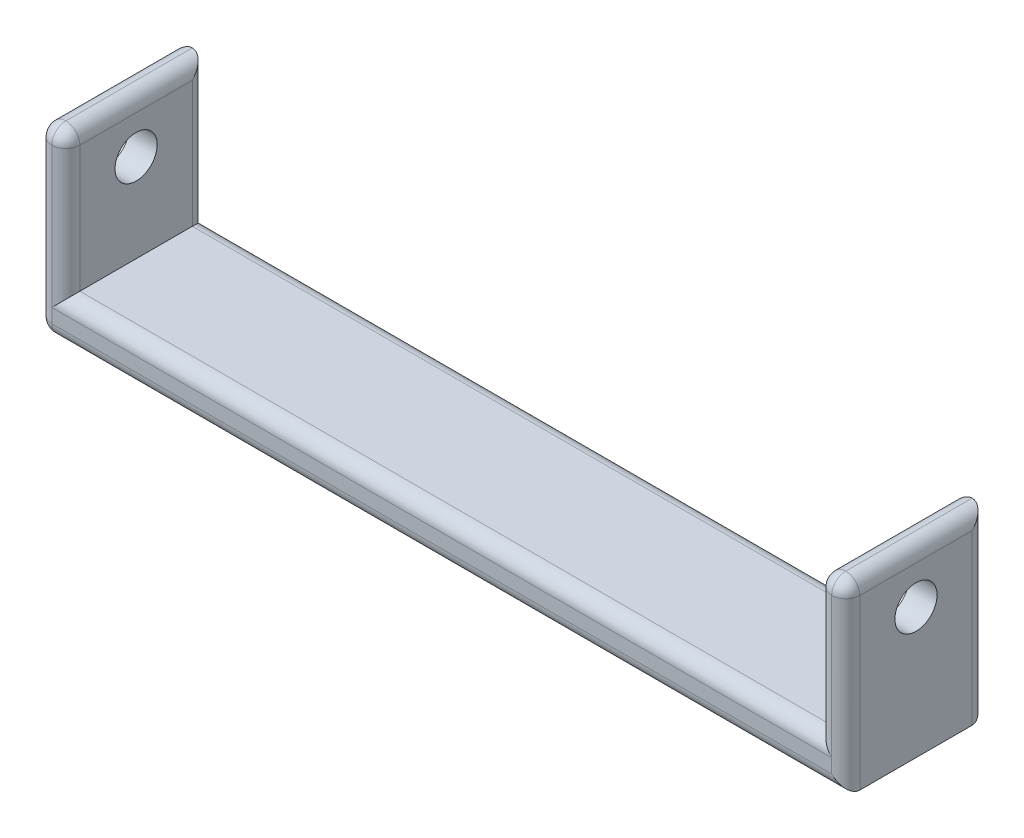
ISO-10303-21;
HEADER;
FILE_DESCRIPTION(('STEP AP214'),'2;1');
FILE_NAME('part.step','',(''),(''),'','','');
FILE_SCHEMA(('AUTOMOTIVE_DESIGN { 1 0 10303 214 1 1 1 1 }'));
ENDSEC;
DATA;
#1=APPLICATION_CONTEXT('core data for automotive mechanical design processes');
#2=APPLICATION_PROTOCOL_DEFINITION('international standard','automotive_design',2000,#1);
#3=PRODUCT_CONTEXT('',#1,'mechanical');
#4=PRODUCT('Part','Part','',(#3));
#5=PRODUCT_RELATED_PRODUCT_CATEGORY('part','',(#4));
#6=PRODUCT_DEFINITION_FORMATION('','',#4);
#7=PRODUCT_DEFINITION_CONTEXT('part definition',#1,'design');
#8=PRODUCT_DEFINITION('design','',#6,#7);
#9=PRODUCT_DEFINITION_SHAPE('','',#8);
#10=(LENGTH_UNIT() NAMED_UNIT(*) SI_UNIT(.MILLI.,.METRE.));
#11=(NAMED_UNIT(*) PLANE_ANGLE_UNIT() SI_UNIT($,.RADIAN.));
#12=(NAMED_UNIT(*) SI_UNIT($,.STERADIAN.) SOLID_ANGLE_UNIT());
#13=UNCERTAINTY_MEASURE_WITH_UNIT(LENGTH_MEASURE(1.E-05),#10,'distance_accuracy_value','');
#14=(GEOMETRIC_REPRESENTATION_CONTEXT(3) GLOBAL_UNCERTAINTY_ASSIGNED_CONTEXT((#13)) GLOBAL_UNIT_ASSIGNED_CONTEXT((#10,
#11,#12)) REPRESENTATION_CONTEXT('',''));
#15=CARTESIAN_POINT('',(0.,0.,0.));
#16=DIRECTION('',(0.,0.,1.));
#17=DIRECTION('',(1.,0.,0.));
#18=AXIS2_PLACEMENT_3D('',#15,#16,#17);
#19=CARTESIAN_POINT('',(0.,3.,0.));
#20=DIRECTION('',(0.,1.,0.));
#21=DIRECTION('',(0.,0.,1.));
#22=AXIS2_PLACEMENT_3D('',#19,#20,#21);
#23=PLANE('',#22);
#24=DIRECTION('',(0.,0.,-1.));
#25=VECTOR('',#24,1.);
#26=CARTESIAN_POINT('',(-26.75,3.,-5.));
#27=LINE('',#26,#25);
#28=CARTESIAN_POINT('',(-26.75,3.,4.));
#29=VERTEX_POINT('',#28);
#30=CARTESIAN_POINT('',(-26.75,3.,-4.));
#31=VERTEX_POINT('',#30);
#32=EDGE_CURVE('E252',#29,#31,#27,.T.);
#33=ORIENTED_EDGE('',*,*,#32,.F.);
#34=DIRECTION('',(1.,0.,0.));
#35=VECTOR('',#34,1.);
#36=CARTESIAN_POINT('',(26.75,3.,4.));
#37=LINE('',#36,#35);
#38=CARTESIAN_POINT('',(26.75,3.,4.));
#39=VERTEX_POINT('',#38);
#40=EDGE_CURVE('E287',#29,#39,#37,.T.);
#41=ORIENTED_EDGE('',*,*,#40,.T.);
#42=DIRECTION('',(0.,0.,1.));
#43=VECTOR('',#42,1.);
#44=CARTESIAN_POINT('',(26.75,3.,-5.));
#45=LINE('',#44,#43);
#46=CARTESIAN_POINT('',(26.75,3.,-4.));
#47=VERTEX_POINT('',#46);
#48=EDGE_CURVE('E249',#47,#39,#45,.T.);
#49=ORIENTED_EDGE('',*,*,#48,.F.);
#50=DIRECTION('',(-1.,0.,0.));
#51=VECTOR('',#50,1.);
#52=CARTESIAN_POINT('',(-26.75,3.,-4.));
#53=LINE('',#52,#51);
#54=EDGE_CURVE('E285',#47,#31,#53,.T.);
#55=ORIENTED_EDGE('',*,*,#54,.T.);
#56=EDGE_LOOP('',(#33,#41,#49,#55));
#57=FACE_BOUND('',#56,.T.);
#58=ADVANCED_FACE('F34',(#57),#23,.T.);
#59=CARTESIAN_POINT('',(28.75,3.,-5.));
#60=DIRECTION('',(-1.,0.,0.));
#61=DIRECTION('',(0.,0.,1.));
#62=AXIS2_PLACEMENT_3D('',#59,#60,#61);
#63=PLANE('',#62);
#64=CARTESIAN_POINT('',(28.75,9.2874124257943,0.));
#65=DIRECTION('',(-1.,0.,0.));
#66=DIRECTION('',(0.,0.,1.));
#67=AXIS2_PLACEMENT_3D('',#64,#65,#66);
#68=CIRCLE('',#67,1.5);
#69=CARTESIAN_POINT('',(28.75,9.2874124257943,1.5));
#70=VERTEX_POINT('',#69);
#71=EDGE_CURVE('E238',#70,#70,#68,.T.);
#72=ORIENTED_EDGE('',*,*,#71,.T.);
#73=EDGE_LOOP('',(#72));
#74=FACE_BOUND('',#73,.T.);
#75=DIRECTION('',(0.,0.,-1.));
#76=VECTOR('',#75,1.);
#77=CARTESIAN_POINT('',(28.75,12.,5.));
#78=LINE('',#77,#76);
#79=CARTESIAN_POINT('',(28.75,12.,-4.));
#80=VERTEX_POINT('',#79);
#81=CARTESIAN_POINT('',(28.75,12.,4.));
#82=VERTEX_POINT('',#81);
#83=EDGE_CURVE('E297',#80,#82,#78,.F.);
#84=ORIENTED_EDGE('',*,*,#83,.T.);
#85=DIRECTION('',(0.,-1.,0.));
#86=VECTOR('',#85,1.);
#87=CARTESIAN_POINT('',(28.75,3.,4.));
#88=LINE('',#87,#86);
#89=CARTESIAN_POINT('',(28.75,0.,4.));
#90=VERTEX_POINT('',#89);
#91=EDGE_CURVE('E299',#82,#90,#88,.T.);
#92=ORIENTED_EDGE('',*,*,#91,.T.);
#93=DIRECTION('',(0.,0.,-1.));
#94=VECTOR('',#93,1.);
#95=CARTESIAN_POINT('',(28.75,0.,-5.));
#96=LINE('',#95,#94);
#97=CARTESIAN_POINT('',(28.75,0.,-4.));
#98=VERTEX_POINT('',#97);
#99=EDGE_CURVE('E255',#90,#98,#96,.T.);
#100=ORIENTED_EDGE('',*,*,#99,.T.);
#101=DIRECTION('',(0.,-1.,0.));
#102=VECTOR('',#101,1.);
#103=CARTESIAN_POINT('',(28.75,3.,-4.));
#104=LINE('',#103,#102);
#105=EDGE_CURVE('E295',#98,#80,#104,.F.);
#106=ORIENTED_EDGE('',*,*,#105,.T.);
#107=EDGE_LOOP('',(#84,#92,#100,#106));
#108=FACE_BOUND('',#107,.T.);
#109=ADVANCED_FACE('F383',(#74,#108),#63,.F.);
#110=CARTESIAN_POINT('',(-28.75,3.,-5.));
#111=DIRECTION('',(0.,0.,1.));
#112=DIRECTION('',(1.,0.,0.));
#113=AXIS2_PLACEMENT_3D('',#110,#111,#112);
#114=PLANE('',#113);
#115=DIRECTION('',(0.,-1.,0.));
#116=VECTOR('',#115,1.);
#117=CARTESIAN_POINT('',(-27.75,3.,-5.));
#118=LINE('',#117,#116);
#119=CARTESIAN_POINT('',(-27.75,1.,-5.));
#120=VERTEX_POINT('',#119);
#121=CARTESIAN_POINT('',(-27.75,2.,-5.));
#122=VERTEX_POINT('',#121);
#123=EDGE_CURVE('E163',#120,#122,#118,.F.);
#124=ORIENTED_EDGE('',*,*,#123,.T.);
#125=DIRECTION('',(-1.,0.,0.));
#126=VECTOR('',#125,1.);
#127=CARTESIAN_POINT('',(26.75,2.,-5.));
#128=LINE('',#127,#126);
#129=CARTESIAN_POINT('',(27.75,2.,-5.));
#130=VERTEX_POINT('',#129);
#131=EDGE_CURVE('E11',#122,#130,#128,.F.);
#132=ORIENTED_EDGE('',*,*,#131,.T.);
#133=DIRECTION('',(0.,-1.,0.));
#134=VECTOR('',#133,1.);
#135=CARTESIAN_POINT('',(27.75,3.,-5.));
#136=LINE('',#135,#134);
#137=CARTESIAN_POINT('',(27.75,1.,-5.));
#138=VERTEX_POINT('',#137);
#139=EDGE_CURVE('E44',#130,#138,#136,.T.);
#140=ORIENTED_EDGE('',*,*,#139,.T.);
#141=DIRECTION('',(-1.,0.,0.));
#142=VECTOR('',#141,1.);
#143=CARTESIAN_POINT('',(-28.75,1.,-5.));
#144=LINE('',#143,#142);
#145=EDGE_CURVE('E160',#138,#120,#144,.T.);
#146=ORIENTED_EDGE('',*,*,#145,.T.);
#147=EDGE_LOOP('',(#124,#132,#140,#146));
#148=FACE_BOUND('',#147,.T.);
#149=ADVANCED_FACE('F162',(#148),#114,.F.);
#150=CARTESIAN_POINT('',(-28.75,3.,-5.));
#151=DIRECTION('',(1.,0.,0.));
#152=DIRECTION('',(0.,0.,-1.));
#153=AXIS2_PLACEMENT_3D('',#150,#151,#152);
#154=PLANE('',#153);
#155=DIRECTION('',(0.,0.,1.));
#156=VECTOR('',#155,1.);
#157=CARTESIAN_POINT('',(-28.75,1.,-5.));
#158=LINE('',#157,#156);
#159=CARTESIAN_POINT('',(-28.75,1.,-4.));
#160=VERTEX_POINT('',#159);
#161=CARTESIAN_POINT('',(-28.75,1.,4.));
#162=VERTEX_POINT('',#161);
#163=EDGE_CURVE('E271',#160,#162,#158,.T.);
#164=ORIENTED_EDGE('',*,*,#163,.T.);
#165=DIRECTION('',(0.,-1.,0.));
#166=VECTOR('',#165,1.);
#167=CARTESIAN_POINT('',(-28.75,3.,4.));
#168=LINE('',#167,#166);
#169=CARTESIAN_POINT('',(-28.75,12.,4.));
#170=VERTEX_POINT('',#169);
#171=EDGE_CURVE('E275',#162,#170,#168,.F.);
#172=ORIENTED_EDGE('',*,*,#171,.T.);
#173=DIRECTION('',(0.,0.,1.));
#174=VECTOR('',#173,1.);
#175=CARTESIAN_POINT('',(-28.75,12.,-5.));
#176=LINE('',#175,#174);
#177=CARTESIAN_POINT('',(-28.75,12.,-4.));
#178=VERTEX_POINT('',#177);
#179=EDGE_CURVE('E273',#170,#178,#176,.F.);
#180=ORIENTED_EDGE('',*,*,#179,.T.);
#181=DIRECTION('',(0.,-1.,0.));
#182=VECTOR('',#181,1.);
#183=CARTESIAN_POINT('',(-28.75,3.,-4.));
#184=LINE('',#183,#182);
#185=EDGE_CURVE('E269',#178,#160,#184,.T.);
#186=ORIENTED_EDGE('',*,*,#185,.T.);
#187=EDGE_LOOP('',(#164,#172,#180,#186));
#188=FACE_BOUND('',#187,.T.);
#189=CARTESIAN_POINT('',(-28.75,9.2874124257943,0.));
#190=DIRECTION('',(-1.,0.,0.));
#191=DIRECTION('',(0.,0.,1.));
#192=AXIS2_PLACEMENT_3D('',#189,#190,#191);
#193=CIRCLE('',#192,1.5);
#194=CARTESIAN_POINT('',(-28.75,9.2874124257943,1.5));
#195=VERTEX_POINT('',#194);
#196=EDGE_CURVE('E233',#195,#195,#193,.T.);
#197=ORIENTED_EDGE('',*,*,#196,.F.);
#198=EDGE_LOOP('',(#197));
#199=FACE_BOUND('',#198,.T.);
#200=ADVANCED_FACE('F400',(#188,#199),#154,.F.);
#201=CARTESIAN_POINT('',(-28.75,3.,5.));
#202=DIRECTION('',(0.,0.,-1.));
#203=DIRECTION('',(-1.,0.,0.));
#204=AXIS2_PLACEMENT_3D('',#201,#202,#203);
#205=PLANE('',#204);
#206=DIRECTION('',(1.,0.,0.));
#207=VECTOR('',#206,1.);
#208=CARTESIAN_POINT('',(-26.75,2.,5.));
#209=LINE('',#208,#207);
#210=CARTESIAN_POINT('',(27.75,2.,5.));
#211=VERTEX_POINT('',#210);
#212=CARTESIAN_POINT('',(-27.75,2.,5.));
#213=VERTEX_POINT('',#212);
#214=EDGE_CURVE('E264',#211,#213,#209,.F.);
#215=ORIENTED_EDGE('',*,*,#214,.T.);
#216=DIRECTION('',(0.,-1.,0.));
#217=VECTOR('',#216,1.);
#218=CARTESIAN_POINT('',(-27.75,3.,5.));
#219=LINE('',#218,#217);
#220=CARTESIAN_POINT('',(-27.75,1.,5.));
#221=VERTEX_POINT('',#220);
#222=EDGE_CURVE('E266',#213,#221,#219,.T.);
#223=ORIENTED_EDGE('',*,*,#222,.T.);
#224=DIRECTION('',(1.,0.,0.));
#225=VECTOR('',#224,1.);
#226=CARTESIAN_POINT('',(-28.75,1.,5.));
#227=LINE('',#226,#225);
#228=CARTESIAN_POINT('',(27.75,1.,5.));
#229=VERTEX_POINT('',#228);
#230=EDGE_CURVE('E258',#221,#229,#227,.T.);
#231=ORIENTED_EDGE('',*,*,#230,.T.);
#232=DIRECTION('',(0.,-1.,0.));
#233=VECTOR('',#232,1.);
#234=CARTESIAN_POINT('',(27.75,3.,5.));
#235=LINE('',#234,#233);
#236=EDGE_CURVE('E262',#229,#211,#235,.F.);
#237=ORIENTED_EDGE('',*,*,#236,.T.);
#238=EDGE_LOOP('',(#215,#223,#231,#237));
#239=FACE_BOUND('',#238,.T.);
#240=ADVANCED_FACE('F396',(#239),#205,.F.);
#241=CARTESIAN_POINT('',(0.,0.,0.));
#242=DIRECTION('',(0.,1.,0.));
#243=DIRECTION('',(0.,0.,1.));
#244=AXIS2_PLACEMENT_3D('',#241,#242,#243);
#245=PLANE('',#244);
#246=ORIENTED_EDGE('',*,*,#99,.F.);
#247=DIRECTION('',(1.,0.,0.));
#248=VECTOR('',#247,1.);
#249=CARTESIAN_POINT('',(0.,0.,4.));
#250=LINE('',#249,#248);
#251=CARTESIAN_POINT('',(-27.75,0.,4.));
#252=VERTEX_POINT('',#251);
#253=EDGE_CURVE('E168',#90,#252,#250,.F.);
#254=ORIENTED_EDGE('',*,*,#253,.T.);
#255=DIRECTION('',(0.,0.,1.));
#256=VECTOR('',#255,1.);
#257=CARTESIAN_POINT('',(-27.75,0.,0.));
#258=LINE('',#257,#256);
#259=CARTESIAN_POINT('',(-27.75,0.,-4.));
#260=VERTEX_POINT('',#259);
#261=EDGE_CURVE('E303',#252,#260,#258,.F.);
#262=ORIENTED_EDGE('',*,*,#261,.T.);
#263=DIRECTION('',(-1.,0.,0.));
#264=VECTOR('',#263,1.);
#265=CARTESIAN_POINT('',(0.,0.,-4.));
#266=LINE('',#265,#264);
#267=EDGE_CURVE('E185',#260,#98,#266,.F.);
#268=ORIENTED_EDGE('',*,*,#267,.T.);
#269=EDGE_LOOP('',(#246,#254,#262,#268));
#270=FACE_BOUND('',#269,.T.);
#271=ADVANCED_FACE('F393',(#270),#245,.F.);
#272=CARTESIAN_POINT('',(-26.75,13.,-5.));
#273=DIRECTION('',(-1.,0.,0.));
#274=DIRECTION('',(0.,0.,1.));
#275=AXIS2_PLACEMENT_3D('',#272,#273,#274);
#276=PLANE('',#275);
#277=CARTESIAN_POINT('',(-26.75,9.2874124257943,0.));
#278=DIRECTION('',(-1.,0.,0.));
#279=DIRECTION('',(0.,0.,1.));
#280=AXIS2_PLACEMENT_3D('',#277,#278,#279);
#281=CIRCLE('',#280,1.5);
#282=CARTESIAN_POINT('',(-26.75,9.2874124257943,1.5));
#283=VERTEX_POINT('',#282);
#284=EDGE_CURVE('E246',#283,#283,#281,.T.);
#285=ORIENTED_EDGE('',*,*,#284,.T.);
#286=EDGE_LOOP('',(#285));
#287=FACE_BOUND('',#286,.T.);
#288=DIRECTION('',(0.,0.,-1.));
#289=VECTOR('',#288,1.);
#290=CARTESIAN_POINT('',(-26.75,12.,-5.));
#291=LINE('',#290,#289);
#292=CARTESIAN_POINT('',(-26.75,12.,-4.));
#293=VERTEX_POINT('',#292);
#294=CARTESIAN_POINT('',(-26.75,12.,4.));
#295=VERTEX_POINT('',#294);
#296=EDGE_CURVE('E280',#293,#295,#291,.F.);
#297=ORIENTED_EDGE('',*,*,#296,.T.);
#298=DIRECTION('',(0.,-1.,0.));
#299=VECTOR('',#298,1.);
#300=CARTESIAN_POINT('',(-26.75,13.,4.));
#301=LINE('',#300,#299);
#302=EDGE_CURVE('E282',#295,#29,#301,.T.);
#303=ORIENTED_EDGE('',*,*,#302,.T.);
#304=ORIENTED_EDGE('',*,*,#32,.T.);
#305=DIRECTION('',(0.,-1.,0.));
#306=VECTOR('',#305,1.);
#307=CARTESIAN_POINT('',(-26.75,13.,-4.));
#308=LINE('',#307,#306);
#309=EDGE_CURVE('E278',#31,#293,#308,.F.);
#310=ORIENTED_EDGE('',*,*,#309,.T.);
#311=EDGE_LOOP('',(#297,#303,#304,#310));
#312=FACE_BOUND('',#311,.T.);
#313=ADVANCED_FACE('F362',(#287,#312),#276,.F.);
#314=CARTESIAN_POINT('',(26.75,13.,-5.));
#315=DIRECTION('',(1.,0.,0.));
#316=DIRECTION('',(0.,0.,-1.));
#317=AXIS2_PLACEMENT_3D('',#314,#315,#316);
#318=PLANE('',#317);
#319=CARTESIAN_POINT('',(26.75,9.2874124257943,0.));
#320=DIRECTION('',(1.,0.,0.));
#321=DIRECTION('',(0.,0.,-1.));
#322=AXIS2_PLACEMENT_3D('',#319,#320,#321);
#323=CIRCLE('',#322,1.5);
#324=CARTESIAN_POINT('',(26.75,9.2874124257943,-1.5));
#325=VERTEX_POINT('',#324);
#326=EDGE_CURVE('E243',#325,#325,#323,.T.);
#327=ORIENTED_EDGE('',*,*,#326,.T.);
#328=EDGE_LOOP('',(#327));
#329=FACE_BOUND('',#328,.T.);
#330=ORIENTED_EDGE('',*,*,#48,.T.);
#331=DIRECTION('',(0.,-1.,0.));
#332=VECTOR('',#331,1.);
#333=CARTESIAN_POINT('',(26.75,13.,4.));
#334=LINE('',#333,#332);
#335=CARTESIAN_POINT('',(26.75,12.,4.));
#336=VERTEX_POINT('',#335);
#337=EDGE_CURVE('E293',#39,#336,#334,.F.);
#338=ORIENTED_EDGE('',*,*,#337,.T.);
#339=DIRECTION('',(0.,0.,1.));
#340=VECTOR('',#339,1.);
#341=CARTESIAN_POINT('',(26.75,12.,-5.));
#342=LINE('',#341,#340);
#343=CARTESIAN_POINT('',(26.75,12.,-4.));
#344=VERTEX_POINT('',#343);
#345=EDGE_CURVE('E291',#336,#344,#342,.F.);
#346=ORIENTED_EDGE('',*,*,#345,.T.);
#347=DIRECTION('',(0.,-1.,0.));
#348=VECTOR('',#347,1.);
#349=CARTESIAN_POINT('',(26.75,13.,-4.));
#350=LINE('',#349,#348);
#351=EDGE_CURVE('E289',#344,#47,#350,.T.);
#352=ORIENTED_EDGE('',*,*,#351,.T.);
#353=EDGE_LOOP('',(#330,#338,#346,#352));
#354=FACE_BOUND('',#353,.T.);
#355=ADVANCED_FACE('F476',(#329,#354),#318,.F.);
#356=CARTESIAN_POINT('',(28.75,9.2874124257943,0.));
#357=DIRECTION('',(-1.,0.,0.));
#358=DIRECTION('',(0.,0.,1.));
#359=AXIS2_PLACEMENT_3D('',#356,#357,#358);
#360=CYLINDRICAL_SURFACE('',#359,1.5);
#361=ORIENTED_EDGE('',*,*,#71,.F.);
#362=EDGE_LOOP('',(#361));
#363=FACE_BOUND('',#362,.T.);
#364=ORIENTED_EDGE('',*,*,#326,.F.);
#365=EDGE_LOOP('',(#364));
#366=FACE_BOUND('',#365,.T.);
#367=ADVANCED_FACE('F478',(#363,#366),#360,.F.);
#368=ORIENTED_EDGE('',*,*,#196,.T.);
#369=EDGE_LOOP('',(#368));
#370=FACE_BOUND('',#369,.T.);
#371=ORIENTED_EDGE('',*,*,#284,.F.);
#372=EDGE_LOOP('',(#371));
#373=FACE_BOUND('',#372,.T.);
#374=ADVANCED_FACE('F484',(#370,#373),#360,.F.);
#375=CARTESIAN_POINT('',(27.75,13.,-4.));
#376=DIRECTION('',(0.,-1.,0.));
#377=DIRECTION('',(0.,0.,-1.));
#378=AXIS2_PLACEMENT_3D('',#375,#376,#377);
#379=CYLINDRICAL_SURFACE('',#378,1.);
#380=DIRECTION('',(0.,-1.,0.));
#381=VECTOR('',#380,1.);
#382=CARTESIAN_POINT('',(27.75,3.,-5.));
#383=LINE('',#382,#381);
#384=CARTESIAN_POINT('',(27.75,13.,-5.));
#385=VERTEX_POINT('',#384);
#386=EDGE_CURVE('E223',#130,#385,#383,.F.);
#387=ORIENTED_EDGE('',*,*,#386,.F.);
#388=CARTESIAN_POINT('',(27.75,2.,-4.));
#389=DIRECTION('',(0.707106781186547,0.707106781186547,0.));
#390=DIRECTION('',(0.707106781186547,-0.707106781186547,0.));
#391=AXIS2_PLACEMENT_3D('',#388,#389,#390);
#392=ELLIPSE('',#391,1.41421356237309,1.);
#393=EDGE_CURVE('E38',#47,#130,#392,.F.);
#394=ORIENTED_EDGE('',*,*,#393,.F.);
#395=ORIENTED_EDGE('',*,*,#351,.F.);
#396=CARTESIAN_POINT('',(27.75,12.,-4.));
#397=DIRECTION('',(0.,-0.707106781186547,-0.707106781186547));
#398=DIRECTION('',(0.,-0.707106781186547,0.707106781186547));
#399=AXIS2_PLACEMENT_3D('',#396,#397,#398);
#400=ELLIPSE('',#399,1.41421356237309,1.);
#401=EDGE_CURVE('E82',#385,#344,#400,.F.);
#402=ORIENTED_EDGE('',*,*,#401,.F.);
#403=EDGE_LOOP('',(#387,#394,#395,#402));
#404=FACE_BOUND('',#403,.T.);
#405=ADVANCED_FACE('F36',(#404),#379,.T.);
#406=CARTESIAN_POINT('',(0.,2.,-4.));
#407=DIRECTION('',(1.,0.,0.));
#408=DIRECTION('',(0.,0.,-1.));
#409=AXIS2_PLACEMENT_3D('',#406,#407,#408);
#410=CYLINDRICAL_SURFACE('',#409,1.);
#411=ORIENTED_EDGE('',*,*,#393,.T.);
#412=ORIENTED_EDGE('',*,*,#131,.F.);
#413=CARTESIAN_POINT('',(-27.75,2.,-4.));
#414=DIRECTION('',(0.707106781186547,-0.707106781186547,0.));
#415=DIRECTION('',(0.707106781186547,0.707106781186547,0.));
#416=AXIS2_PLACEMENT_3D('',#413,#414,#415);
#417=ELLIPSE('',#416,1.41421356237309,1.);
#418=EDGE_CURVE('E220',#31,#122,#417,.F.);
#419=ORIENTED_EDGE('',*,*,#418,.F.);
#420=ORIENTED_EDGE('',*,*,#54,.F.);
#421=EDGE_LOOP('',(#411,#412,#419,#420));
#422=FACE_BOUND('',#421,.T.);
#423=ADVANCED_FACE('F366',(#422),#410,.T.);
#424=CARTESIAN_POINT('',(27.75,12.,0.));
#425=DIRECTION('',(0.,0.,-1.));
#426=DIRECTION('',(-1.,0.,0.));
#427=AXIS2_PLACEMENT_3D('',#424,#425,#426);
#428=CYLINDRICAL_SURFACE('',#427,1.);
#429=CARTESIAN_POINT('',(27.75,12.,4.));
#430=DIRECTION('',(0.,0.,1.));
#431=DIRECTION('',(1.,0.,0.));
#432=AXIS2_PLACEMENT_3D('',#429,#430,#431);
#433=CIRCLE('',#432,1.);
#434=CARTESIAN_POINT('',(27.75,13.,4.));
#435=VERTEX_POINT('',#434);
#436=EDGE_CURVE('E218',#435,#336,#433,.T.);
#437=ORIENTED_EDGE('',*,*,#436,.F.);
#438=DIRECTION('',(0.,0.,1.));
#439=VECTOR('',#438,1.);
#440=CARTESIAN_POINT('',(27.75,13.,5.));
#441=LINE('',#440,#439);
#442=EDGE_CURVE('E228',#385,#435,#441,.T.);
#443=ORIENTED_EDGE('',*,*,#442,.F.);
#444=ORIENTED_EDGE('',*,*,#401,.T.);
#445=ORIENTED_EDGE('',*,*,#345,.F.);
#446=EDGE_LOOP('',(#437,#443,#444,#445));
#447=FACE_BOUND('',#446,.T.);
#448=ADVANCED_FACE('F460',(#447),#428,.T.);
#449=CARTESIAN_POINT('',(27.75,12.,0.));
#450=DIRECTION('',(0.,0.,1.));
#451=DIRECTION('',(1.,0.,0.));
#452=AXIS2_PLACEMENT_3D('',#449,#450,#451);
#453=CYLINDRICAL_SURFACE('',#452,1.);
#454=CARTESIAN_POINT('',(27.75,12.,4.));
#455=DIRECTION('',(0.,0.,1.));
#456=DIRECTION('',(0.,-1.,0.));
#457=AXIS2_PLACEMENT_3D('',#454,#455,#456);
#458=CIRCLE('',#457,1.);
#459=EDGE_CURVE('E214',#82,#435,#458,.T.);
#460=ORIENTED_EDGE('',*,*,#459,.F.);
#461=ORIENTED_EDGE('',*,*,#83,.F.);
#462=CARTESIAN_POINT('',(27.75,12.,-4.));
#463=DIRECTION('',(0.,-0.707106781186547,-0.707106781186547));
#464=DIRECTION('',(0.,-0.707106781186547,0.707106781186547));
#465=AXIS2_PLACEMENT_3D('',#462,#463,#464);
#466=ELLIPSE('',#465,1.41421356237309,1.);
#467=EDGE_CURVE('E225',#385,#80,#466,.T.);
#468=ORIENTED_EDGE('',*,*,#467,.F.);
#469=ORIENTED_EDGE('',*,*,#442,.T.);
#470=EDGE_LOOP('',(#460,#461,#468,#469));
#471=FACE_BOUND('',#470,.T.);
#472=ADVANCED_FACE('F380',(#471),#453,.T.);
#473=CARTESIAN_POINT('',(27.75,3.,-4.));
#474=DIRECTION('',(0.,-1.,0.));
#475=DIRECTION('',(0.,0.,-1.));
#476=AXIS2_PLACEMENT_3D('',#473,#474,#475);
#477=CYLINDRICAL_SURFACE('',#476,1.);
#478=ORIENTED_EDGE('',*,*,#467,.T.);
#479=ORIENTED_EDGE('',*,*,#105,.F.);
#480=CARTESIAN_POINT('',(27.75,1.,-4.));
#481=DIRECTION('',(-0.707106781186547,-0.707106781186547,0.));
#482=DIRECTION('',(-0.707106781186547,0.707106781186547,0.));
#483=AXIS2_PLACEMENT_3D('',#480,#481,#482);
#484=ELLIPSE('',#483,1.41421356237309,1.);
#485=EDGE_CURVE('E212',#138,#98,#484,.T.);
#486=ORIENTED_EDGE('',*,*,#485,.F.);
#487=ORIENTED_EDGE('',*,*,#139,.F.);
#488=ORIENTED_EDGE('',*,*,#386,.T.);
#489=EDGE_LOOP('',(#478,#479,#486,#487,#488));
#490=FACE_BOUND('',#489,.T.);
#491=ADVANCED_FACE('F372',(#490),#477,.T.);
#492=CARTESIAN_POINT('',(-27.75,3.,-4.));
#493=DIRECTION('',(0.,-1.,0.));
#494=DIRECTION('',(0.,0.,-1.));
#495=AXIS2_PLACEMENT_3D('',#492,#493,#494);
#496=CYLINDRICAL_SURFACE('',#495,1.);
#497=ORIENTED_EDGE('',*,*,#309,.F.);
#498=ORIENTED_EDGE('',*,*,#418,.T.);
#499=DIRECTION('',(0.,-1.,0.));
#500=VECTOR('',#499,1.);
#501=CARTESIAN_POINT('',(-27.75,3.,-5.));
#502=LINE('',#501,#500);
#503=CARTESIAN_POINT('',(-27.75,13.,-5.));
#504=VERTEX_POINT('',#503);
#505=EDGE_CURVE('E179',#504,#122,#502,.T.);
#506=ORIENTED_EDGE('',*,*,#505,.F.);
#507=CARTESIAN_POINT('',(-27.75,12.,-4.));
#508=DIRECTION('',(0.,-0.707106781186547,-0.707106781186547));
#509=DIRECTION('',(0.,-0.707106781186547,0.707106781186547));
#510=AXIS2_PLACEMENT_3D('',#507,#508,#509);
#511=ELLIPSE('',#510,1.41421356237309,1.);
#512=EDGE_CURVE('E208',#293,#504,#511,.F.);
#513=ORIENTED_EDGE('',*,*,#512,.F.);
#514=EDGE_LOOP('',(#497,#498,#506,#513));
#515=FACE_BOUND('',#514,.T.);
#516=ADVANCED_FACE('F369',(#515),#496,.T.);
#517=CARTESIAN_POINT('',(27.75,12.,4.));
#518=DIRECTION('',(0.,1.,0.));
#519=DIRECTION('',(0.,0.,1.));
#520=AXIS2_PLACEMENT_3D('',#517,#518,#519);
#521=SPHERICAL_SURFACE('',#520,1.);
#522=CARTESIAN_POINT('',(27.75,12.,4.));
#523=DIRECTION('',(-1.,0.,0.));
#524=DIRECTION('',(0.,0.,1.));
#525=AXIS2_PLACEMENT_3D('',#522,#523,#524);
#526=CIRCLE('',#525,1.);
#527=CARTESIAN_POINT('',(27.75,12.,5.));
#528=VERTEX_POINT('',#527);
#529=EDGE_CURVE('E75',#528,#435,#526,.T.);
#530=ORIENTED_EDGE('',*,*,#529,.T.);
#531=ORIENTED_EDGE('',*,*,#436,.T.);
#532=CARTESIAN_POINT('',(27.75,12.,4.));
#533=DIRECTION('',(0.,1.,0.));
#534=DIRECTION('',(0.,0.,1.));
#535=AXIS2_PLACEMENT_3D('',#532,#533,#534);
#536=CIRCLE('',#535,1.);
#537=EDGE_CURVE('E205',#528,#336,#536,.F.);
#538=ORIENTED_EDGE('',*,*,#537,.F.);
#539=EDGE_LOOP('',(#530,#531,#538));
#540=FACE_BOUND('',#539,.T.);
#541=ADVANCED_FACE('F371',(#540),#521,.T.);
#542=CARTESIAN_POINT('',(27.75,12.,4.));
#543=DIRECTION('',(0.,1.,0.));
#544=DIRECTION('',(0.,0.,1.));
#545=AXIS2_PLACEMENT_3D('',#542,#543,#544);
#546=SPHERICAL_SURFACE('',#545,1.);
#547=ORIENTED_EDGE('',*,*,#459,.T.);
#548=ORIENTED_EDGE('',*,*,#529,.F.);
#549=CARTESIAN_POINT('',(27.75,12.,4.));
#550=DIRECTION('',(0.,1.,0.));
#551=DIRECTION('',(0.,0.,1.));
#552=AXIS2_PLACEMENT_3D('',#549,#550,#551);
#553=CIRCLE('',#552,1.);
#554=EDGE_CURVE('E188',#82,#528,#553,.F.);
#555=ORIENTED_EDGE('',*,*,#554,.F.);
#556=EDGE_LOOP('',(#547,#548,#555));
#557=FACE_BOUND('',#556,.T.);
#558=ADVANCED_FACE('F378',(#557),#546,.T.);
#559=CARTESIAN_POINT('',(-28.75,1.,-4.));
#560=DIRECTION('',(-1.,0.,0.));
#561=DIRECTION('',(0.,0.,1.));
#562=AXIS2_PLACEMENT_3D('',#559,#560,#561);
#563=CYLINDRICAL_SURFACE('',#562,1.);
#564=ORIENTED_EDGE('',*,*,#485,.T.);
#565=ORIENTED_EDGE('',*,*,#267,.F.);
#566=CARTESIAN_POINT('',(-27.75,1.,-4.));
#567=DIRECTION('',(-1.,0.,0.));
#568=DIRECTION('',(0.,0.,1.));
#569=AXIS2_PLACEMENT_3D('',#566,#567,#568);
#570=CIRCLE('',#569,1.);
#571=EDGE_CURVE('E183',#120,#260,#570,.T.);
#572=ORIENTED_EDGE('',*,*,#571,.F.);
#573=ORIENTED_EDGE('',*,*,#145,.F.);
#574=EDGE_LOOP('',(#564,#565,#572,#573));
#575=FACE_BOUND('',#574,.T.);
#576=ADVANCED_FACE('F184',(#575),#563,.T.);
#577=CARTESIAN_POINT('',(-27.75,3.,-4.));
#578=DIRECTION('',(0.,-1.,0.));
#579=DIRECTION('',(0.,0.,-1.));
#580=AXIS2_PLACEMENT_3D('',#577,#578,#579);
#581=CYLINDRICAL_SURFACE('',#580,1.);
#582=ORIENTED_EDGE('',*,*,#505,.T.);
#583=ORIENTED_EDGE('',*,*,#123,.F.);
#584=CARTESIAN_POINT('',(-27.75,1.,-4.));
#585=DIRECTION('',(0.,-1.,0.));
#586=DIRECTION('',(0.,0.,-1.));
#587=AXIS2_PLACEMENT_3D('',#584,#585,#586);
#588=CIRCLE('',#587,1.);
#589=EDGE_CURVE('E176',#160,#120,#588,.T.);
#590=ORIENTED_EDGE('',*,*,#589,.F.);
#591=ORIENTED_EDGE('',*,*,#185,.F.);
#592=CARTESIAN_POINT('',(-27.75,12.,-4.));
#593=DIRECTION('',(0.,-0.707106781186547,-0.707106781186547));
#594=DIRECTION('',(0.,-0.707106781186547,0.707106781186547));
#595=AXIS2_PLACEMENT_3D('',#592,#593,#594);
#596=ELLIPSE('',#595,1.41421356237309,1.);
#597=EDGE_CURVE('E193',#504,#178,#596,.F.);
#598=ORIENTED_EDGE('',*,*,#597,.F.);
#599=EDGE_LOOP('',(#582,#583,#590,#591,#598));
#600=FACE_BOUND('',#599,.T.);
#601=ADVANCED_FACE('F173',(#600),#581,.T.);
#602=CARTESIAN_POINT('',(-27.75,12.,0.));
#603=DIRECTION('',(0.,0.,-1.));
#604=DIRECTION('',(-1.,0.,0.));
#605=AXIS2_PLACEMENT_3D('',#602,#603,#604);
#606=CYLINDRICAL_SURFACE('',#605,1.);
#607=ORIENTED_EDGE('',*,*,#296,.F.);
#608=ORIENTED_EDGE('',*,*,#512,.T.);
#609=DIRECTION('',(0.,0.,-1.));
#610=VECTOR('',#609,1.);
#611=CARTESIAN_POINT('',(-27.75,13.,0.));
#612=LINE('',#611,#610);
#613=CARTESIAN_POINT('',(-27.75,13.,4.));
#614=VERTEX_POINT('',#613);
#615=EDGE_CURVE('E196',#614,#504,#612,.T.);
#616=ORIENTED_EDGE('',*,*,#615,.F.);
#617=CARTESIAN_POINT('',(-27.75,12.,4.));
#618=DIRECTION('',(0.,0.,1.));
#619=DIRECTION('',(1.,0.,0.));
#620=AXIS2_PLACEMENT_3D('',#617,#618,#619);
#621=CIRCLE('',#620,1.);
#622=EDGE_CURVE('E336',#295,#614,#621,.T.);
#623=ORIENTED_EDGE('',*,*,#622,.F.);
#624=EDGE_LOOP('',(#607,#608,#616,#623));
#625=FACE_BOUND('',#624,.T.);
#626=ADVANCED_FACE('F346',(#625),#606,.T.);
#627=CARTESIAN_POINT('',(27.75,3.,4.));
#628=DIRECTION('',(0.,-1.,0.));
#629=DIRECTION('',(0.,0.,-1.));
#630=AXIS2_PLACEMENT_3D('',#627,#628,#629);
#631=CYLINDRICAL_SURFACE('',#630,1.);
#632=CARTESIAN_POINT('',(27.75,2.,4.));
#633=DIRECTION('',(-0.707106781186547,-0.707106781186547,0.));
#634=DIRECTION('',(-0.707106781186547,0.707106781186547,0.));
#635=AXIS2_PLACEMENT_3D('',#632,#633,#634);
#636=ELLIPSE('',#635,1.41421356237309,1.);
#637=EDGE_CURVE('E333',#211,#39,#636,.T.);
#638=ORIENTED_EDGE('',*,*,#637,.F.);
#639=DIRECTION('',(0.,-1.,0.));
#640=VECTOR('',#639,1.);
#641=CARTESIAN_POINT('',(27.75,3.,5.));
#642=LINE('',#641,#640);
#643=EDGE_CURVE('E202',#528,#211,#642,.T.);
#644=ORIENTED_EDGE('',*,*,#643,.F.);
#645=ORIENTED_EDGE('',*,*,#537,.T.);
#646=ORIENTED_EDGE('',*,*,#337,.F.);
#647=EDGE_LOOP('',(#638,#644,#645,#646));
#648=FACE_BOUND('',#647,.T.);
#649=ADVANCED_FACE('F439',(#648),#631,.T.);
#650=CARTESIAN_POINT('',(27.75,3.,4.));
#651=DIRECTION('',(0.,-1.,0.));
#652=DIRECTION('',(0.,0.,-1.));
#653=AXIS2_PLACEMENT_3D('',#650,#651,#652);
#654=CYLINDRICAL_SURFACE('',#653,1.);
#655=ORIENTED_EDGE('',*,*,#643,.T.);
#656=ORIENTED_EDGE('',*,*,#236,.F.);
#657=CARTESIAN_POINT('',(27.75,1.,4.));
#658=DIRECTION('',(0.707106781186547,0.707106781186547,0.));
#659=DIRECTION('',(0.707106781186547,-0.707106781186547,0.));
#660=AXIS2_PLACEMENT_3D('',#657,#658,#659);
#661=ELLIPSE('',#660,1.41421356237309,1.);
#662=EDGE_CURVE('E330',#90,#229,#661,.F.);
#663=ORIENTED_EDGE('',*,*,#662,.F.);
#664=ORIENTED_EDGE('',*,*,#91,.F.);
#665=ORIENTED_EDGE('',*,*,#554,.T.);
#666=EDGE_LOOP('',(#655,#656,#663,#664,#665));
#667=FACE_BOUND('',#666,.T.);
#668=ADVANCED_FACE('F436',(#667),#654,.T.);
#669=CARTESIAN_POINT('',(-27.75,1.,-4.));
#670=DIRECTION('',(0.,0.,-1.));
#671=DIRECTION('',(-1.,0.,0.));
#672=AXIS2_PLACEMENT_3D('',#669,#670,#671);
#673=SPHERICAL_SURFACE('',#672,1.);
#674=ORIENTED_EDGE('',*,*,#589,.T.);
#675=ORIENTED_EDGE('',*,*,#571,.T.);
#676=CARTESIAN_POINT('',(-27.75,1.,-4.));
#677=DIRECTION('',(0.,0.,-1.));
#678=DIRECTION('',(-1.,0.,0.));
#679=AXIS2_PLACEMENT_3D('',#676,#677,#678);
#680=CIRCLE('',#679,1.);
#681=EDGE_CURVE('E191',#160,#260,#680,.F.);
#682=ORIENTED_EDGE('',*,*,#681,.F.);
#683=EDGE_LOOP('',(#674,#675,#682));
#684=FACE_BOUND('',#683,.T.);
#685=ADVANCED_FACE('F190',(#684),#673,.T.);
#686=CARTESIAN_POINT('',(-27.75,12.,0.));
#687=DIRECTION('',(0.,0.,1.));
#688=DIRECTION('',(1.,0.,0.));
#689=AXIS2_PLACEMENT_3D('',#686,#687,#688);
#690=CYLINDRICAL_SURFACE('',#689,1.);
#691=CARTESIAN_POINT('',(-27.75,12.,4.));
#692=DIRECTION('',(0.,0.,1.));
#693=DIRECTION('',(1.,0.,0.));
#694=AXIS2_PLACEMENT_3D('',#691,#692,#693);
#695=CIRCLE('',#694,1.);
#696=EDGE_CURVE('E326',#614,#170,#695,.T.);
#697=ORIENTED_EDGE('',*,*,#696,.F.);
#698=ORIENTED_EDGE('',*,*,#615,.T.);
#699=ORIENTED_EDGE('',*,*,#597,.T.);
#700=ORIENTED_EDGE('',*,*,#179,.F.);
#701=EDGE_LOOP('',(#697,#698,#699,#700));
#702=FACE_BOUND('',#701,.T.);
#703=ADVANCED_FACE('F341',(#702),#690,.T.);
#704=CARTESIAN_POINT('',(-27.75,12.,4.));
#705=DIRECTION('',(0.,1.,0.));
#706=DIRECTION('',(0.,0.,1.));
#707=AXIS2_PLACEMENT_3D('',#704,#705,#706);
#708=SPHERICAL_SURFACE('',#707,1.);
#709=ORIENTED_EDGE('',*,*,#622,.T.);
#710=CARTESIAN_POINT('',(-27.75,12.,4.));
#711=DIRECTION('',(-1.,0.,0.));
#712=DIRECTION('',(0.,0.,1.));
#713=AXIS2_PLACEMENT_3D('',#710,#711,#712);
#714=CIRCLE('',#713,1.);
#715=CARTESIAN_POINT('',(-27.75,12.,5.));
#716=VERTEX_POINT('',#715);
#717=EDGE_CURVE('E323',#716,#614,#714,.T.);
#718=ORIENTED_EDGE('',*,*,#717,.F.);
#719=CARTESIAN_POINT('',(-27.75,12.,4.));
#720=DIRECTION('',(0.,1.,0.));
#721=DIRECTION('',(0.,0.,1.));
#722=AXIS2_PLACEMENT_3D('',#719,#720,#721);
#723=CIRCLE('',#722,1.);
#724=EDGE_CURVE('E320',#295,#716,#723,.F.);
#725=ORIENTED_EDGE('',*,*,#724,.F.);
#726=EDGE_LOOP('',(#709,#718,#725));
#727=FACE_BOUND('',#726,.T.);
#728=ADVANCED_FACE('F353',(#727),#708,.T.);
#729=CARTESIAN_POINT('',(0.,2.,4.));
#730=DIRECTION('',(-1.,0.,0.));
#731=DIRECTION('',(0.,0.,1.));
#732=AXIS2_PLACEMENT_3D('',#729,#730,#731);
#733=CYLINDRICAL_SURFACE('',#732,1.);
#734=ORIENTED_EDGE('',*,*,#637,.T.);
#735=ORIENTED_EDGE('',*,*,#40,.F.);
#736=CARTESIAN_POINT('',(-27.75,2.,4.));
#737=DIRECTION('',(0.707106781186547,-0.707106781186547,0.));
#738=DIRECTION('',(-0.707106781186547,-0.707106781186547,0.));
#739=AXIS2_PLACEMENT_3D('',#736,#737,#738);
#740=ELLIPSE('',#739,1.41421356237309,1.);
#741=EDGE_CURVE('E318',#213,#29,#740,.F.);
#742=ORIENTED_EDGE('',*,*,#741,.F.);
#743=ORIENTED_EDGE('',*,*,#214,.F.);
#744=EDGE_LOOP('',(#734,#735,#742,#743));
#745=FACE_BOUND('',#744,.T.);
#746=ADVANCED_FACE('F425',(#745),#733,.T.);
#747=CARTESIAN_POINT('',(-28.75,1.,4.));
#748=DIRECTION('',(1.,0.,0.));
#749=DIRECTION('',(0.,0.,-1.));
#750=AXIS2_PLACEMENT_3D('',#747,#748,#749);
#751=CYLINDRICAL_SURFACE('',#750,1.);
#752=ORIENTED_EDGE('',*,*,#662,.T.);
#753=ORIENTED_EDGE('',*,*,#230,.F.);
#754=CARTESIAN_POINT('',(-27.75,1.,4.));
#755=DIRECTION('',(-1.,0.,0.));
#756=DIRECTION('',(0.,0.,1.));
#757=AXIS2_PLACEMENT_3D('',#754,#755,#756);
#758=CIRCLE('',#757,1.);
#759=EDGE_CURVE('E316',#252,#221,#758,.T.);
#760=ORIENTED_EDGE('',*,*,#759,.F.);
#761=ORIENTED_EDGE('',*,*,#253,.F.);
#762=EDGE_LOOP('',(#752,#753,#760,#761));
#763=FACE_BOUND('',#762,.T.);
#764=ADVANCED_FACE('F421',(#763),#751,.T.);
#765=CARTESIAN_POINT('',(-27.75,1.,-5.));
#766=DIRECTION('',(0.,0.,1.));
#767=DIRECTION('',(1.,0.,0.));
#768=AXIS2_PLACEMENT_3D('',#765,#766,#767);
#769=CYLINDRICAL_SURFACE('',#768,1.);
#770=ORIENTED_EDGE('',*,*,#681,.T.);
#771=ORIENTED_EDGE('',*,*,#261,.F.);
#772=CARTESIAN_POINT('',(-27.75,1.,4.));
#773=DIRECTION('',(0.,0.,1.));
#774=DIRECTION('',(1.,0.,0.));
#775=AXIS2_PLACEMENT_3D('',#772,#773,#774);
#776=CIRCLE('',#775,1.);
#777=EDGE_CURVE('E313',#162,#252,#776,.T.);
#778=ORIENTED_EDGE('',*,*,#777,.F.);
#779=ORIENTED_EDGE('',*,*,#163,.F.);
#780=EDGE_LOOP('',(#770,#771,#778,#779));
#781=FACE_BOUND('',#780,.T.);
#782=ADVANCED_FACE('F418',(#781),#769,.T.);
#783=CARTESIAN_POINT('',(-27.75,12.,4.));
#784=DIRECTION('',(0.,1.,0.));
#785=DIRECTION('',(0.,0.,1.));
#786=AXIS2_PLACEMENT_3D('',#783,#784,#785);
#787=SPHERICAL_SURFACE('',#786,1.);
#788=ORIENTED_EDGE('',*,*,#717,.T.);
#789=ORIENTED_EDGE('',*,*,#696,.T.);
#790=CARTESIAN_POINT('',(-27.75,12.,4.));
#791=DIRECTION('',(0.,1.,0.));
#792=DIRECTION('',(0.,0.,1.));
#793=AXIS2_PLACEMENT_3D('',#790,#791,#792);
#794=CIRCLE('',#793,1.);
#795=EDGE_CURVE('E311',#716,#170,#794,.F.);
#796=ORIENTED_EDGE('',*,*,#795,.F.);
#797=EDGE_LOOP('',(#788,#789,#796));
#798=FACE_BOUND('',#797,.T.);
#799=ADVANCED_FACE('F351',(#798),#787,.T.);
#800=CARTESIAN_POINT('',(-27.75,13.,4.));
#801=DIRECTION('',(0.,-1.,0.));
#802=DIRECTION('',(0.,0.,-1.));
#803=AXIS2_PLACEMENT_3D('',#800,#801,#802);
#804=CYLINDRICAL_SURFACE('',#803,1.);
#805=ORIENTED_EDGE('',*,*,#302,.F.);
#806=ORIENTED_EDGE('',*,*,#724,.T.);
#807=DIRECTION('',(0.,-1.,0.));
#808=VECTOR('',#807,1.);
#809=CARTESIAN_POINT('',(-27.75,3.,5.));
#810=LINE('',#809,#808);
#811=EDGE_CURVE('E308',#213,#716,#810,.F.);
#812=ORIENTED_EDGE('',*,*,#811,.F.);
#813=ORIENTED_EDGE('',*,*,#741,.T.);
#814=EDGE_LOOP('',(#805,#806,#812,#813));
#815=FACE_BOUND('',#814,.T.);
#816=ADVANCED_FACE('F357',(#815),#804,.T.);
#817=CARTESIAN_POINT('',(-27.75,1.,4.));
#818=DIRECTION('',(0.,-1.,0.));
#819=DIRECTION('',(0.,0.,-1.));
#820=AXIS2_PLACEMENT_3D('',#817,#818,#819);
#821=SPHERICAL_SURFACE('',#820,1.);
#822=ORIENTED_EDGE('',*,*,#777,.T.);
#823=ORIENTED_EDGE('',*,*,#759,.T.);
#824=CARTESIAN_POINT('',(-27.75,1.,4.));
#825=DIRECTION('',(0.,-1.,0.));
#826=DIRECTION('',(0.,0.,-1.));
#827=AXIS2_PLACEMENT_3D('',#824,#825,#826);
#828=CIRCLE('',#827,1.);
#829=EDGE_CURVE('E91',#162,#221,#828,.F.);
#830=ORIENTED_EDGE('',*,*,#829,.F.);
#831=EDGE_LOOP('',(#822,#823,#830));
#832=FACE_BOUND('',#831,.T.);
#833=ADVANCED_FACE('F410',(#832),#821,.T.);
#834=CARTESIAN_POINT('',(-27.75,3.,4.));
#835=DIRECTION('',(0.,-1.,0.));
#836=DIRECTION('',(0.,0.,-1.));
#837=AXIS2_PLACEMENT_3D('',#834,#835,#836);
#838=CYLINDRICAL_SURFACE('',#837,1.);
#839=ORIENTED_EDGE('',*,*,#795,.T.);
#840=ORIENTED_EDGE('',*,*,#171,.F.);
#841=ORIENTED_EDGE('',*,*,#829,.T.);
#842=ORIENTED_EDGE('',*,*,#222,.F.);
#843=ORIENTED_EDGE('',*,*,#811,.T.);
#844=EDGE_LOOP('',(#839,#840,#841,#842,#843));
#845=FACE_BOUND('',#844,.T.);
#846=ADVANCED_FACE('F407',(#845),#838,.T.);
#847=CLOSED_SHELL('',(#58,#109,#149,#200,#240,#271,#313,#355,#367,#374,#405,#423,#448,#472,#491,
#516,#541,#558,#576,#601,#626,#649,#668,#685,#703,#728,#746,#764,#782,#799,#816,#833,#846));
#848=MANIFOLD_SOLID_BREP('B2',#847);
#849=ADVANCED_BREP_SHAPE_REPRESENTATION('',(#18,#848),#14);
#850=SHAPE_DEFINITION_REPRESENTATION(#9,#849);
ENDSEC;
END-ISO-10303-21;
